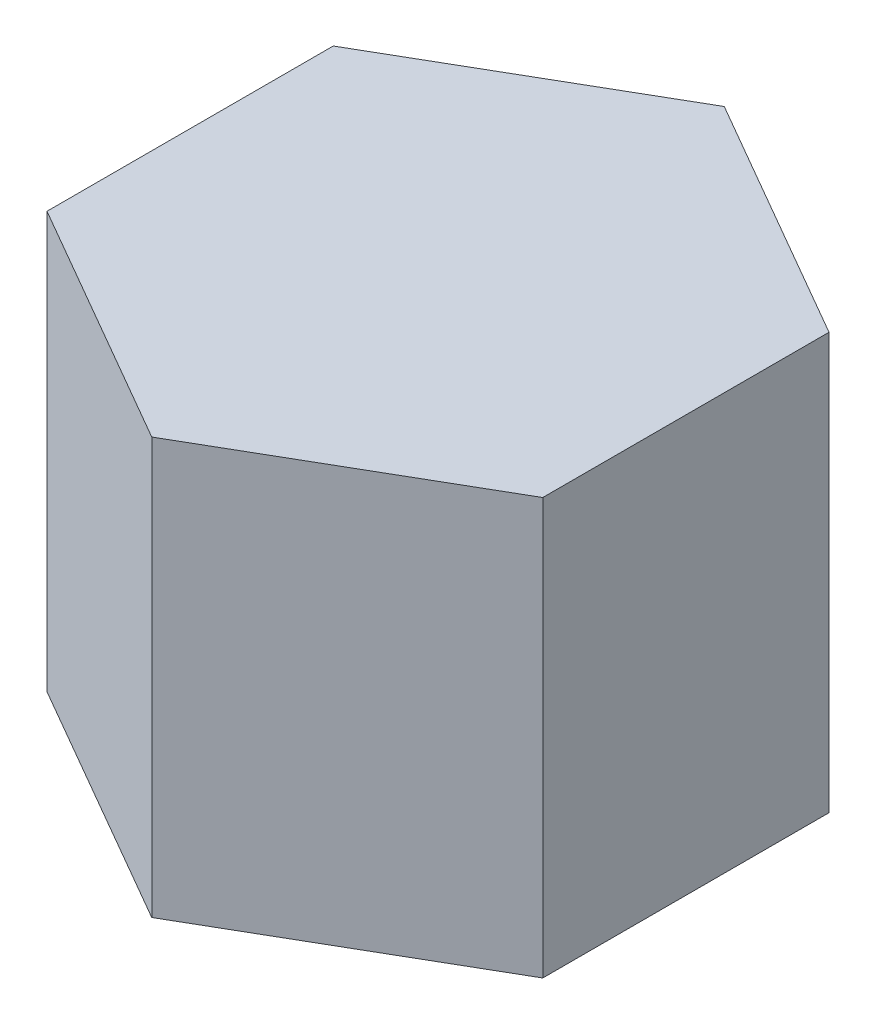
ISO-10303-21;
HEADER;
FILE_DESCRIPTION(('STEP AP214'),'2;1');
FILE_NAME('part.step','',(''),(''),'','','');
FILE_SCHEMA(('AUTOMOTIVE_DESIGN { 1 0 10303 214 1 1 1 1 }'));
ENDSEC;
DATA;
#1=APPLICATION_CONTEXT('core data for automotive mechanical design processes');
#2=APPLICATION_PROTOCOL_DEFINITION('international standard','automotive_design',2000,#1);
#3=PRODUCT_CONTEXT('',#1,'mechanical');
#4=PRODUCT('Part','Part','',(#3));
#5=PRODUCT_RELATED_PRODUCT_CATEGORY('part','',(#4));
#6=PRODUCT_DEFINITION_FORMATION('','',#4);
#7=PRODUCT_DEFINITION_CONTEXT('part definition',#1,'design');
#8=PRODUCT_DEFINITION('design','',#6,#7);
#9=PRODUCT_DEFINITION_SHAPE('','',#8);
#10=(LENGTH_UNIT() NAMED_UNIT(*) SI_UNIT(.MILLI.,.METRE.));
#11=(NAMED_UNIT(*) PLANE_ANGLE_UNIT() SI_UNIT($,.RADIAN.));
#12=(NAMED_UNIT(*) SI_UNIT($,.STERADIAN.) SOLID_ANGLE_UNIT());
#13=UNCERTAINTY_MEASURE_WITH_UNIT(LENGTH_MEASURE(1.E-05),#10,'distance_accuracy_value','');
#14=(GEOMETRIC_REPRESENTATION_CONTEXT(3) GLOBAL_UNCERTAINTY_ASSIGNED_CONTEXT((#13)) GLOBAL_UNIT_ASSIGNED_CONTEXT((#10,
#11,#12)) REPRESENTATION_CONTEXT('',''));
#15=CARTESIAN_POINT('',(0.,0.,0.));
#16=DIRECTION('',(0.,0.,1.));
#17=DIRECTION('',(1.,0.,0.));
#18=AXIS2_PLACEMENT_3D('',#15,#16,#17);
#19=CARTESIAN_POINT('',(210.839551417382,-147.556598747966,292.547996624279));
#20=DIRECTION('',(-0.499999999999943,0.,-0.866025403784471));
#21=DIRECTION('',(-0.866025403784471,0.,0.499999999999943));
#22=AXIS2_PLACEMENT_3D('',#19,#20,#21);
#23=PLANE('',#22);
#24=CARTESIAN_POINT('',(211.142660308706,-147.047793579175,292.372996624279));
#25=DIRECTION('',(-0.866025403784471,0.,0.499999999999943));
#26=VECTOR('',#25,1.);
#27=LINE('',#24,#26);
#28=CARTESIAN_POINT('',(211.142660308706,-147.047793579175,292.372996624279));
#29=VERTEX_POINT('',#28);
#30=CARTESIAN_POINT('',(210.839551417382,-147.047793579175,292.547996624279));
#31=VERTEX_POINT('',#30);
#32=EDGE_CURVE('E170',#29,#31,#27,.T.);
#33=ORIENTED_EDGE('',*,*,#32,.T.);
#34=CARTESIAN_POINT('',(210.839551417382,-147.556598747966,292.547996624279));
#35=DIRECTION('',(0.,1.,0.));
#36=VECTOR('',#35,1.);
#37=LINE('',#34,#36);
#38=CARTESIAN_POINT('',(210.839551417382,-147.556598747966,292.547996624279));
#39=VERTEX_POINT('',#38);
#40=EDGE_CURVE('E35',#39,#31,#37,.T.);
#41=ORIENTED_EDGE('',*,*,#40,.F.);
#42=CARTESIAN_POINT('',(211.142660308706,-147.556598747966,292.372996624279));
#43=DIRECTION('',(-0.866025403784471,0.,0.499999999999943));
#44=VECTOR('',#43,1.);
#45=LINE('',#42,#44);
#46=CARTESIAN_POINT('',(211.142660308706,-147.556598747966,292.372996624279));
#47=VERTEX_POINT('',#46);
#48=EDGE_CURVE('E159',#47,#39,#45,.T.);
#49=ORIENTED_EDGE('',*,*,#48,.F.);
#50=CARTESIAN_POINT('',(211.142660308706,-147.556598747966,292.372996624279));
#51=DIRECTION('',(0.,1.,0.));
#52=VECTOR('',#51,1.);
#53=LINE('',#50,#52);
#54=EDGE_CURVE('E10',#47,#29,#53,.T.);
#55=ORIENTED_EDGE('',*,*,#54,.T.);
#56=EDGE_LOOP('',(#33,#41,#49,#55));
#57=FACE_BOUND('',#56,.T.);
#58=ADVANCED_FACE('F16',(#57),#23,.F.);
#59=CARTESIAN_POINT('',(211.142660308706,-147.556598747966,291.594471220494));
#60=DIRECTION('',(-1.,0.,0.));
#61=DIRECTION('',(0.,-1.,0.));
#62=AXIS2_PLACEMENT_3D('',#59,#60,#61);
#63=PLANE('',#62);
#64=CARTESIAN_POINT('',(211.142660308706,-147.047793579175,292.022996624279));
#65=DIRECTION('',(0.,0.,1.));
#66=VECTOR('',#65,1.);
#67=LINE('',#64,#66);
#68=CARTESIAN_POINT('',(211.142660308706,-147.047793579175,292.022996624279));
#69=VERTEX_POINT('',#68);
#70=EDGE_CURVE('E167',#69,#29,#67,.T.);
#71=ORIENTED_EDGE('',*,*,#70,.T.);
#72=ORIENTED_EDGE('',*,*,#54,.F.);
#73=CARTESIAN_POINT('',(211.142660308706,-147.556598747966,292.022996624279));
#74=DIRECTION('',(0.,0.,1.));
#75=VECTOR('',#74,1.);
#76=LINE('',#73,#75);
#77=CARTESIAN_POINT('',(211.142660308706,-147.556598747966,292.022996624279));
#78=VERTEX_POINT('',#77);
#79=EDGE_CURVE('E156',#78,#47,#76,.T.);
#80=ORIENTED_EDGE('',*,*,#79,.F.);
#81=CARTESIAN_POINT('',(211.142660308706,-147.556598747966,292.022996624279));
#82=DIRECTION('',(0.,1.,0.));
#83=VECTOR('',#82,1.);
#84=LINE('',#81,#83);
#85=EDGE_CURVE('E27',#78,#69,#84,.T.);
#86=ORIENTED_EDGE('',*,*,#85,.T.);
#87=EDGE_LOOP('',(#71,#72,#80,#86));
#88=FACE_BOUND('',#87,.T.);
#89=ADVANCED_FACE('F189',(#88),#63,.F.);
#90=CARTESIAN_POINT('',(211.142660308706,-147.556598747966,292.022996624279));
#91=DIRECTION('',(-0.500000000000062,0.,0.866025403784403));
#92=DIRECTION('',(0.866025403784403,0.,0.500000000000062));
#93=AXIS2_PLACEMENT_3D('',#90,#91,#92);
#94=PLANE('',#93);
#95=CARTESIAN_POINT('',(210.839551417382,-147.047793579175,291.847996624279));
#96=DIRECTION('',(0.866025403784403,0.,0.500000000000062));
#97=VECTOR('',#96,1.);
#98=LINE('',#95,#97);
#99=CARTESIAN_POINT('',(210.839551417382,-147.047793579175,291.847996624279));
#100=VERTEX_POINT('',#99);
#101=EDGE_CURVE('E163',#100,#69,#98,.T.);
#102=ORIENTED_EDGE('',*,*,#101,.T.);
#103=ORIENTED_EDGE('',*,*,#85,.F.);
#104=CARTESIAN_POINT('',(210.839551417382,-147.556598747966,291.847996624279));
#105=DIRECTION('',(0.866025403784403,0.,0.500000000000062));
#106=VECTOR('',#105,1.);
#107=LINE('',#104,#106);
#108=CARTESIAN_POINT('',(210.839551417382,-147.556598747966,291.847996624279));
#109=VERTEX_POINT('',#108);
#110=EDGE_CURVE('E106',#109,#78,#107,.T.);
#111=ORIENTED_EDGE('',*,*,#110,.F.);
#112=CARTESIAN_POINT('',(210.839551417382,-147.556598747966,291.847996624279));
#113=DIRECTION('',(0.,1.,0.));
#114=VECTOR('',#113,1.);
#115=LINE('',#112,#114);
#116=EDGE_CURVE('E94',#109,#100,#115,.T.);
#117=ORIENTED_EDGE('',*,*,#116,.T.);
#118=EDGE_LOOP('',(#102,#103,#111,#117));
#119=FACE_BOUND('',#118,.T.);
#120=ADVANCED_FACE('F198',(#119),#94,.F.);
#121=CARTESIAN_POINT('',(210.839551417382,-147.556598747966,291.847996624279));
#122=DIRECTION('',(0.499999999999943,0.,0.866025403784471));
#123=DIRECTION('',(0.866025403784471,0.,-0.499999999999943));
#124=AXIS2_PLACEMENT_3D('',#121,#122,#123);
#125=PLANE('',#124);
#126=CARTESIAN_POINT('',(210.536442526057,-147.047793579175,292.022996624279));
#127=DIRECTION('',(0.866025403784471,0.,-0.499999999999943));
#128=VECTOR('',#127,1.);
#129=LINE('',#126,#128);
#130=CARTESIAN_POINT('',(210.536442526057,-147.047793579175,292.022996624279));
#131=VERTEX_POINT('',#130);
#132=EDGE_CURVE('E162',#131,#100,#129,.T.);
#133=ORIENTED_EDGE('',*,*,#132,.T.);
#134=ORIENTED_EDGE('',*,*,#116,.F.);
#135=CARTESIAN_POINT('',(210.536442526057,-147.556598747966,292.022996624279));
#136=DIRECTION('',(0.866025403784471,0.,-0.499999999999943));
#137=VECTOR('',#136,1.);
#138=LINE('',#135,#137);
#139=CARTESIAN_POINT('',(210.536442526057,-147.556598747966,292.022996624279));
#140=VERTEX_POINT('',#139);
#141=EDGE_CURVE('E98',#140,#109,#138,.T.);
#142=ORIENTED_EDGE('',*,*,#141,.F.);
#143=CARTESIAN_POINT('',(210.536442526057,-147.556598747966,292.022996624279));
#144=DIRECTION('',(0.,1.,0.));
#145=VECTOR('',#144,1.);
#146=LINE('',#143,#145);
#147=EDGE_CURVE('E79',#140,#131,#146,.T.);
#148=ORIENTED_EDGE('',*,*,#147,.T.);
#149=EDGE_LOOP('',(#133,#134,#142,#148));
#150=FACE_BOUND('',#149,.T.);
#151=ADVANCED_FACE('F100',(#150),#125,.F.);
#152=CARTESIAN_POINT('',(210.536442526057,-147.556598747966,291.594471220494));
#153=DIRECTION('',(1.,0.,0.));
#154=DIRECTION('',(0.,1.,0.));
#155=AXIS2_PLACEMENT_3D('',#152,#153,#154);
#156=PLANE('',#155);
#157=CARTESIAN_POINT('',(210.536442526057,-147.047793579175,292.372996624279));
#158=DIRECTION('',(0.,0.,-1.));
#159=VECTOR('',#158,1.);
#160=LINE('',#157,#159);
#161=CARTESIAN_POINT('',(210.536442526057,-147.047793579175,292.372996624279));
#162=VERTEX_POINT('',#161);
#163=EDGE_CURVE('E88',#162,#131,#160,.T.);
#164=ORIENTED_EDGE('',*,*,#163,.T.);
#165=ORIENTED_EDGE('',*,*,#147,.F.);
#166=CARTESIAN_POINT('',(210.536442526057,-147.556598747966,292.372996624279));
#167=DIRECTION('',(0.,0.,-1.));
#168=VECTOR('',#167,1.);
#169=LINE('',#166,#168);
#170=CARTESIAN_POINT('',(210.536442526057,-147.556598747966,292.372996624279));
#171=VERTEX_POINT('',#170);
#172=EDGE_CURVE('E84',#171,#140,#169,.T.);
#173=ORIENTED_EDGE('',*,*,#172,.F.);
#174=CARTESIAN_POINT('',(210.536442526057,-147.556598747966,292.372996624279));
#175=DIRECTION('',(0.,1.,0.));
#176=VECTOR('',#175,1.);
#177=LINE('',#174,#176);
#178=EDGE_CURVE('E58',#171,#162,#177,.T.);
#179=ORIENTED_EDGE('',*,*,#178,.T.);
#180=EDGE_LOOP('',(#164,#165,#173,#179));
#181=FACE_BOUND('',#180,.T.);
#182=ADVANCED_FACE('F82',(#181),#156,.F.);
#183=CARTESIAN_POINT('',(210.536442526057,-147.556598747966,292.372996624279));
#184=DIRECTION('',(0.500000000000062,0.,-0.866025403784403));
#185=DIRECTION('',(-0.866025403784403,0.,-0.500000000000062));
#186=AXIS2_PLACEMENT_3D('',#183,#184,#185);
#187=PLANE('',#186);
#188=CARTESIAN_POINT('',(210.839551417382,-147.047793579175,292.547996624279));
#189=DIRECTION('',(-0.866025403784403,0.,-0.500000000000062));
#190=VECTOR('',#189,1.);
#191=LINE('',#188,#190);
#192=EDGE_CURVE('E160',#31,#162,#191,.T.);
#193=ORIENTED_EDGE('',*,*,#192,.T.);
#194=ORIENTED_EDGE('',*,*,#178,.F.);
#195=CARTESIAN_POINT('',(210.839551417382,-147.556598747966,292.547996624279));
#196=DIRECTION('',(-0.866025403784403,0.,-0.500000000000062));
#197=VECTOR('',#196,1.);
#198=LINE('',#195,#197);
#199=EDGE_CURVE('E112',#39,#171,#198,.T.);
#200=ORIENTED_EDGE('',*,*,#199,.F.);
#201=ORIENTED_EDGE('',*,*,#40,.T.);
#202=EDGE_LOOP('',(#193,#194,#200,#201));
#203=FACE_BOUND('',#202,.T.);
#204=ADVANCED_FACE('F131',(#203),#187,.F.);
#205=CARTESIAN_POINT('',(206.491105863044,-147.556598747966,291.594471220494));
#206=DIRECTION('',(0.,1.,0.));
#207=DIRECTION('',(-1.,0.,0.));
#208=AXIS2_PLACEMENT_3D('',#205,#206,#207);
#209=PLANE('',#208);
#210=ORIENTED_EDGE('',*,*,#48,.T.);
#211=ORIENTED_EDGE('',*,*,#199,.T.);
#212=ORIENTED_EDGE('',*,*,#172,.T.);
#213=ORIENTED_EDGE('',*,*,#141,.T.);
#214=ORIENTED_EDGE('',*,*,#110,.T.);
#215=ORIENTED_EDGE('',*,*,#79,.T.);
#216=EDGE_LOOP('',(#210,#211,#212,#213,#214,#215));
#217=FACE_BOUND('',#216,.T.);
#218=ADVANCED_FACE('F111',(#217),#209,.F.);
#219=CARTESIAN_POINT('',(206.491105863044,-147.047793579175,291.594471220494));
#220=DIRECTION('',(0.,1.,0.));
#221=DIRECTION('',(-1.,0.,0.));
#222=AXIS2_PLACEMENT_3D('',#219,#220,#221);
#223=PLANE('',#222);
#224=ORIENTED_EDGE('',*,*,#32,.F.);
#225=ORIENTED_EDGE('',*,*,#70,.F.);
#226=ORIENTED_EDGE('',*,*,#101,.F.);
#227=ORIENTED_EDGE('',*,*,#132,.F.);
#228=ORIENTED_EDGE('',*,*,#163,.F.);
#229=ORIENTED_EDGE('',*,*,#192,.F.);
#230=EDGE_LOOP('',(#224,#225,#226,#227,#228,#229));
#231=FACE_BOUND('',#230,.T.);
#232=ADVANCED_FACE('F130',(#231),#223,.T.);
#233=CLOSED_SHELL('',(#58,#89,#120,#151,#182,#204,#218,#232));
#234=MANIFOLD_SOLID_BREP('B1',#233);
#235=ADVANCED_BREP_SHAPE_REPRESENTATION('',(#18,#234),#14);
#236=SHAPE_DEFINITION_REPRESENTATION(#9,#235);
ENDSEC;
END-ISO-10303-21;
